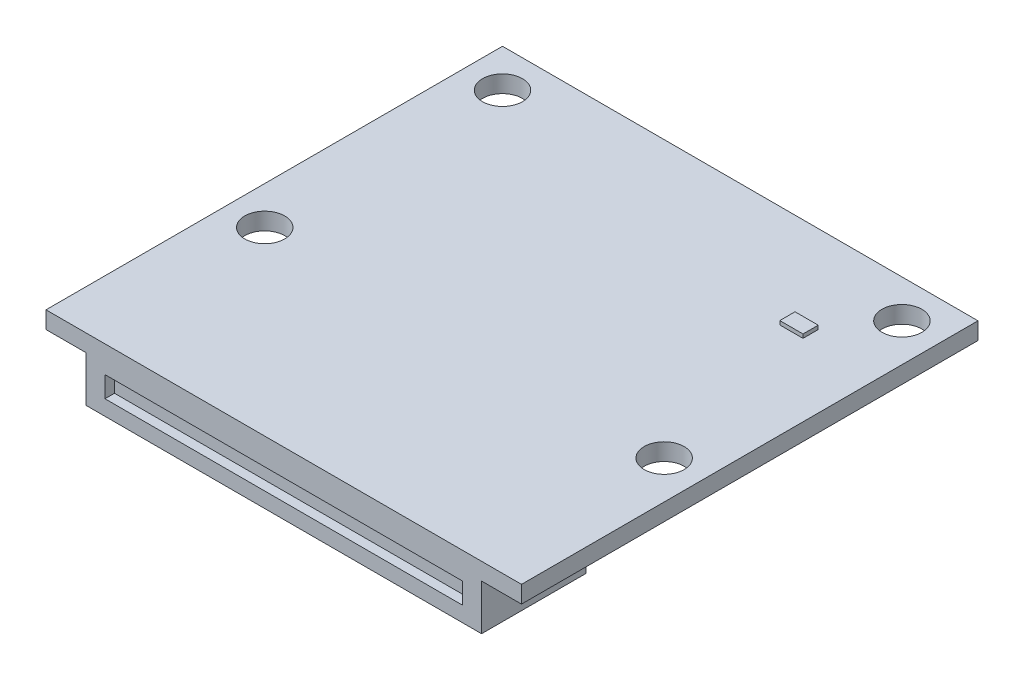
ISO-10303-21;
HEADER;
FILE_DESCRIPTION(('STEP AP214'),'2;1');
FILE_NAME('part.step','',(''),(''),'','','');
FILE_SCHEMA(('AUTOMOTIVE_DESIGN { 1 0 10303 214 1 1 1 1 }'));
ENDSEC;
DATA;
#1=APPLICATION_CONTEXT('core data for automotive mechanical design processes');
#2=APPLICATION_PROTOCOL_DEFINITION('international standard','automotive_design',2000,#1);
#3=PRODUCT_CONTEXT('',#1,'mechanical');
#4=PRODUCT('Part','Part','',(#3));
#5=PRODUCT_RELATED_PRODUCT_CATEGORY('part','',(#4));
#6=PRODUCT_DEFINITION_FORMATION('','',#4);
#7=PRODUCT_DEFINITION_CONTEXT('part definition',#1,'design');
#8=PRODUCT_DEFINITION('design','',#6,#7);
#9=PRODUCT_DEFINITION_SHAPE('','',#8);
#10=(LENGTH_UNIT() NAMED_UNIT(*) SI_UNIT(.MILLI.,.METRE.));
#11=(NAMED_UNIT(*) PLANE_ANGLE_UNIT() SI_UNIT($,.RADIAN.));
#12=(NAMED_UNIT(*) SI_UNIT($,.STERADIAN.) SOLID_ANGLE_UNIT());
#13=UNCERTAINTY_MEASURE_WITH_UNIT(LENGTH_MEASURE(1.E-05),#10,'distance_accuracy_value','');
#14=(GEOMETRIC_REPRESENTATION_CONTEXT(3) GLOBAL_UNCERTAINTY_ASSIGNED_CONTEXT((#13)) GLOBAL_UNIT_ASSIGNED_CONTEXT((#10,
#11,#12)) REPRESENTATION_CONTEXT('',''));
#15=CARTESIAN_POINT('',(0.,0.,0.));
#16=DIRECTION('',(0.,0.,1.));
#17=DIRECTION('',(1.,0.,0.));
#18=AXIS2_PLACEMENT_3D('',#15,#16,#17);
#19=CARTESIAN_POINT('',(0.,0.,0.));
#20=DIRECTION('',(0.,1.,0.));
#21=DIRECTION('',(0.,0.,1.));
#22=AXIS2_PLACEMENT_3D('',#19,#20,#21);
#23=PLANE('',#22);
#24=DIRECTION('',(0.,0.,1.));
#25=VECTOR('',#24,1.);
#26=CARTESIAN_POINT('',(-12.5,0.,-14.5));
#27=LINE('',#26,#25);
#28=CARTESIAN_POINT('',(-12.5,0.,-14.5));
#29=VERTEX_POINT('',#28);
#30=CARTESIAN_POINT('',(-12.5,0.,9.5));
#31=VERTEX_POINT('',#30);
#32=EDGE_CURVE('E275',#29,#31,#27,.T.);
#33=ORIENTED_EDGE('',*,*,#32,.T.);
#34=DIRECTION('',(1.,0.,0.));
#35=VECTOR('',#34,1.);
#36=CARTESIAN_POINT('',(-12.5,0.,9.5));
#37=LINE('',#36,#35);
#38=CARTESIAN_POINT('',(12.5,0.,9.5));
#39=VERTEX_POINT('',#38);
#40=EDGE_CURVE('E278',#31,#39,#37,.T.);
#41=ORIENTED_EDGE('',*,*,#40,.T.);
#42=DIRECTION('',(0.,0.,-1.));
#43=VECTOR('',#42,1.);
#44=CARTESIAN_POINT('',(12.5,0.,-14.5));
#45=LINE('',#44,#43);
#46=CARTESIAN_POINT('',(12.5,0.,-14.5));
#47=VERTEX_POINT('',#46);
#48=EDGE_CURVE('E282',#39,#47,#45,.T.);
#49=ORIENTED_EDGE('',*,*,#48,.T.);
#50=DIRECTION('',(-1.,0.,0.));
#51=VECTOR('',#50,1.);
#52=CARTESIAN_POINT('',(-12.5,0.,-14.5));
#53=LINE('',#52,#51);
#54=EDGE_CURVE('E285',#47,#29,#53,.T.);
#55=ORIENTED_EDGE('',*,*,#54,.T.);
#56=EDGE_LOOP('',(#33,#41,#49,#55));
#57=FACE_BOUND('',#56,.T.);
#58=CARTESIAN_POINT('',(10.5,0.,-12.5));
#59=DIRECTION('',(0.,1.,0.));
#60=DIRECTION('',(0.,0.,1.));
#61=AXIS2_PLACEMENT_3D('',#58,#59,#60);
#62=CIRCLE('',#61,1.05);
#63=CARTESIAN_POINT('',(10.5,0.,-11.45));
#64=VERTEX_POINT('',#63);
#65=EDGE_CURVE('E337',#64,#64,#62,.T.);
#66=ORIENTED_EDGE('',*,*,#65,.F.);
#67=EDGE_LOOP('',(#66));
#68=FACE_BOUND('',#67,.T.);
#69=CARTESIAN_POINT('',(10.5,0.,0.));
#70=DIRECTION('',(0.,1.,0.));
#71=DIRECTION('',(0.,0.,1.));
#72=AXIS2_PLACEMENT_3D('',#69,#70,#71);
#73=CIRCLE('',#72,1.05);
#74=CARTESIAN_POINT('',(10.5,0.,1.05));
#75=VERTEX_POINT('',#74);
#76=EDGE_CURVE('E331',#75,#75,#73,.T.);
#77=ORIENTED_EDGE('',*,*,#76,.F.);
#78=EDGE_LOOP('',(#77));
#79=FACE_BOUND('',#78,.T.);
#80=CARTESIAN_POINT('',(-10.5,0.,0.));
#81=DIRECTION('',(0.,1.,0.));
#82=DIRECTION('',(0.,0.,-1.));
#83=AXIS2_PLACEMENT_3D('',#80,#81,#82);
#84=CIRCLE('',#83,1.05);
#85=CARTESIAN_POINT('',(-10.5,0.,-1.05));
#86=VERTEX_POINT('',#85);
#87=EDGE_CURVE('E326',#86,#86,#84,.T.);
#88=ORIENTED_EDGE('',*,*,#87,.F.);
#89=EDGE_LOOP('',(#88));
#90=FACE_BOUND('',#89,.T.);
#91=CARTESIAN_POINT('',(-10.5,0.,-12.5));
#92=DIRECTION('',(0.,1.,0.));
#93=DIRECTION('',(0.,0.,-1.));
#94=AXIS2_PLACEMENT_3D('',#91,#92,#93);
#95=CIRCLE('',#94,1.05);
#96=CARTESIAN_POINT('',(-10.5,0.,-13.55));
#97=VERTEX_POINT('',#96);
#98=EDGE_CURVE('E320',#97,#97,#95,.T.);
#99=ORIENTED_EDGE('',*,*,#98,.F.);
#100=EDGE_LOOP('',(#99));
#101=FACE_BOUND('',#100,.T.);
#102=DIRECTION('',(-1.,0.,0.));
#103=VECTOR('',#102,1.);
#104=CARTESIAN_POINT('',(8.7,0.,-9.9));
#105=LINE('',#104,#103);
#106=CARTESIAN_POINT('',(8.7,0.,-9.9));
#107=VERTEX_POINT('',#106);
#108=CARTESIAN_POINT('',(7.48,0.,-9.9));
#109=VERTEX_POINT('',#108);
#110=EDGE_CURVE('E204',#107,#109,#105,.T.);
#111=ORIENTED_EDGE('',*,*,#110,.F.);
#112=DIRECTION('',(0.,0.,-1.));
#113=VECTOR('',#112,1.);
#114=CARTESIAN_POINT('',(8.7,0.,-9.1));
#115=LINE('',#114,#113);
#116=CARTESIAN_POINT('',(8.7,0.,-9.1));
#117=VERTEX_POINT('',#116);
#118=EDGE_CURVE('E187',#117,#107,#115,.T.);
#119=ORIENTED_EDGE('',*,*,#118,.F.);
#120=DIRECTION('',(1.,0.,0.));
#121=VECTOR('',#120,1.);
#122=CARTESIAN_POINT('',(8.7,0.,-9.1));
#123=LINE('',#122,#121);
#124=CARTESIAN_POINT('',(7.48,0.,-9.1));
#125=VERTEX_POINT('',#124);
#126=EDGE_CURVE('E195',#125,#117,#123,.T.);
#127=ORIENTED_EDGE('',*,*,#126,.F.);
#128=DIRECTION('',(0.,0.,1.));
#129=VECTOR('',#128,1.);
#130=CARTESIAN_POINT('',(7.48,0.,-9.1));
#131=LINE('',#130,#129);
#132=EDGE_CURVE('E206',#109,#125,#131,.T.);
#133=ORIENTED_EDGE('',*,*,#132,.F.);
#134=EDGE_LOOP('',(#111,#119,#127,#133));
#135=FACE_BOUND('',#134,.T.);
#136=ADVANCED_FACE('F37',(#57,#68,#79,#90,#101,#135),#23,.T.);
#137=CARTESIAN_POINT('',(0.,-0.9,0.));
#138=DIRECTION('',(0.,1.,0.));
#139=DIRECTION('',(0.,0.,1.));
#140=AXIS2_PLACEMENT_3D('',#137,#138,#139);
#141=PLANE('',#140);
#142=CARTESIAN_POINT('',(10.5,-0.9,-12.5));
#143=DIRECTION('',(0.,1.,0.));
#144=DIRECTION('',(0.,0.,1.));
#145=AXIS2_PLACEMENT_3D('',#142,#143,#144);
#146=CIRCLE('',#145,1.05);
#147=CARTESIAN_POINT('',(10.5,-0.9,-11.45));
#148=VERTEX_POINT('',#147);
#149=EDGE_CURVE('E279',#148,#148,#146,.T.);
#150=ORIENTED_EDGE('',*,*,#149,.T.);
#151=EDGE_LOOP('',(#150));
#152=FACE_BOUND('',#151,.T.);
#153=CARTESIAN_POINT('',(10.5,-0.9,0.));
#154=DIRECTION('',(0.,1.,0.));
#155=DIRECTION('',(0.,0.,1.));
#156=AXIS2_PLACEMENT_3D('',#153,#154,#155);
#157=CIRCLE('',#156,1.05);
#158=CARTESIAN_POINT('',(10.5,-0.9,1.05));
#159=VERTEX_POINT('',#158);
#160=EDGE_CURVE('E334',#159,#159,#157,.T.);
#161=ORIENTED_EDGE('',*,*,#160,.T.);
#162=EDGE_LOOP('',(#161));
#163=FACE_BOUND('',#162,.T.);
#164=CARTESIAN_POINT('',(-10.5,-0.9,0.));
#165=DIRECTION('',(0.,1.,0.));
#166=DIRECTION('',(0.,0.,-1.));
#167=AXIS2_PLACEMENT_3D('',#164,#165,#166);
#168=CIRCLE('',#167,1.05);
#169=CARTESIAN_POINT('',(-10.5,-0.9,-1.05));
#170=VERTEX_POINT('',#169);
#171=EDGE_CURVE('E328',#170,#170,#168,.T.);
#172=ORIENTED_EDGE('',*,*,#171,.T.);
#173=EDGE_LOOP('',(#172));
#174=FACE_BOUND('',#173,.T.);
#175=CARTESIAN_POINT('',(-10.5,-0.9,-12.5));
#176=DIRECTION('',(0.,1.,0.));
#177=DIRECTION('',(0.,0.,-1.));
#178=AXIS2_PLACEMENT_3D('',#175,#176,#177);
#179=CIRCLE('',#178,1.05);
#180=CARTESIAN_POINT('',(-10.5,-0.9,-13.55));
#181=VERTEX_POINT('',#180);
#182=EDGE_CURVE('E322',#181,#181,#179,.T.);
#183=ORIENTED_EDGE('',*,*,#182,.T.);
#184=EDGE_LOOP('',(#183));
#185=FACE_BOUND('',#184,.T.);
#186=DIRECTION('',(0.,0.,-1.));
#187=VECTOR('',#186,1.);
#188=CARTESIAN_POINT('',(-10.4,-0.9,9.5));
#189=LINE('',#188,#187);
#190=CARTESIAN_POINT('',(-10.4,-0.9,9.5));
#191=VERTEX_POINT('',#190);
#192=CARTESIAN_POINT('',(-10.4,-0.9,4.));
#193=VERTEX_POINT('',#192);
#194=EDGE_CURVE('E217',#191,#193,#189,.T.);
#195=ORIENTED_EDGE('',*,*,#194,.F.);
#196=DIRECTION('',(1.,0.,0.));
#197=VECTOR('',#196,1.);
#198=CARTESIAN_POINT('',(-12.5,-0.9,9.5));
#199=LINE('',#198,#197);
#200=CARTESIAN_POINT('',(-12.5,-0.9,9.5));
#201=VERTEX_POINT('',#200);
#202=EDGE_CURVE('E260',#201,#191,#199,.T.);
#203=ORIENTED_EDGE('',*,*,#202,.F.);
#204=DIRECTION('',(0.,0.,1.));
#205=VECTOR('',#204,1.);
#206=CARTESIAN_POINT('',(-12.5,-0.9,-14.5));
#207=LINE('',#206,#205);
#208=CARTESIAN_POINT('',(-12.5,-0.9,-14.5));
#209=VERTEX_POINT('',#208);
#210=EDGE_CURVE('E261',#209,#201,#207,.T.);
#211=ORIENTED_EDGE('',*,*,#210,.F.);
#212=DIRECTION('',(-1.,0.,0.));
#213=VECTOR('',#212,1.);
#214=CARTESIAN_POINT('',(-12.5,-0.9,-14.5));
#215=LINE('',#214,#213);
#216=CARTESIAN_POINT('',(12.5,-0.9,-14.5));
#217=VERTEX_POINT('',#216);
#218=EDGE_CURVE('E271',#217,#209,#215,.T.);
#219=ORIENTED_EDGE('',*,*,#218,.F.);
#220=DIRECTION('',(0.,0.,-1.));
#221=VECTOR('',#220,1.);
#222=CARTESIAN_POINT('',(12.5,-0.9,-14.5));
#223=LINE('',#222,#221);
#224=CARTESIAN_POINT('',(12.5,-0.9,9.5));
#225=VERTEX_POINT('',#224);
#226=EDGE_CURVE('E267',#225,#217,#223,.T.);
#227=ORIENTED_EDGE('',*,*,#226,.F.);
#228=CARTESIAN_POINT('',(10.4,-0.9,9.5));
#229=VERTEX_POINT('',#228);
#230=EDGE_CURVE('E257',#229,#225,#199,.T.);
#231=ORIENTED_EDGE('',*,*,#230,.F.);
#232=DIRECTION('',(0.,0.,1.));
#233=VECTOR('',#232,1.);
#234=CARTESIAN_POINT('',(10.4,-0.9,9.5));
#235=LINE('',#234,#233);
#236=CARTESIAN_POINT('',(10.4,-0.9,4.));
#237=VERTEX_POINT('',#236);
#238=EDGE_CURVE('E222',#237,#229,#235,.T.);
#239=ORIENTED_EDGE('',*,*,#238,.F.);
#240=DIRECTION('',(1.,0.,0.));
#241=VECTOR('',#240,1.);
#242=CARTESIAN_POINT('',(-10.4,-0.9,4.));
#243=LINE('',#242,#241);
#244=EDGE_CURVE('E229',#193,#237,#243,.T.);
#245=ORIENTED_EDGE('',*,*,#244,.F.);
#246=EDGE_LOOP('',(#195,#203,#211,#219,#227,#231,#239,#245));
#247=FACE_BOUND('',#246,.T.);
#248=ADVANCED_FACE('F307',(#152,#163,#174,#185,#247),#141,.F.);
#249=CARTESIAN_POINT('',(-12.5,-0.9,-14.5));
#250=DIRECTION('',(-1.,0.,0.));
#251=DIRECTION('',(0.,0.,1.));
#252=AXIS2_PLACEMENT_3D('',#249,#250,#251);
#253=PLANE('',#252);
#254=ORIENTED_EDGE('',*,*,#32,.F.);
#255=DIRECTION('',(0.,1.,0.));
#256=VECTOR('',#255,1.);
#257=CARTESIAN_POINT('',(-12.5,-0.9,-14.5));
#258=LINE('',#257,#256);
#259=EDGE_CURVE('E11',#209,#29,#258,.T.);
#260=ORIENTED_EDGE('',*,*,#259,.F.);
#261=ORIENTED_EDGE('',*,*,#210,.T.);
#262=DIRECTION('',(0.,1.,0.));
#263=VECTOR('',#262,1.);
#264=CARTESIAN_POINT('',(-12.5,-0.9,9.5));
#265=LINE('',#264,#263);
#266=EDGE_CURVE('E274',#201,#31,#265,.T.);
#267=ORIENTED_EDGE('',*,*,#266,.T.);
#268=EDGE_LOOP('',(#254,#260,#261,#267));
#269=FACE_BOUND('',#268,.T.);
#270=ADVANCED_FACE('F39',(#269),#253,.T.);
#271=CARTESIAN_POINT('',(-12.5,-0.9,-14.5));
#272=DIRECTION('',(0.,0.,-1.));
#273=DIRECTION('',(-1.,0.,0.));
#274=AXIS2_PLACEMENT_3D('',#271,#272,#273);
#275=PLANE('',#274);
#276=ORIENTED_EDGE('',*,*,#54,.F.);
#277=DIRECTION('',(0.,1.,0.));
#278=VECTOR('',#277,1.);
#279=CARTESIAN_POINT('',(12.5,-0.9,-14.5));
#280=LINE('',#279,#278);
#281=EDGE_CURVE('E46',#217,#47,#280,.T.);
#282=ORIENTED_EDGE('',*,*,#281,.F.);
#283=ORIENTED_EDGE('',*,*,#218,.T.);
#284=ORIENTED_EDGE('',*,*,#259,.T.);
#285=EDGE_LOOP('',(#276,#282,#283,#284));
#286=FACE_BOUND('',#285,.T.);
#287=ADVANCED_FACE('F304',(#286),#275,.T.);
#288=CARTESIAN_POINT('',(12.5,-0.9,-14.5));
#289=DIRECTION('',(1.,0.,0.));
#290=DIRECTION('',(0.,0.,-1.));
#291=AXIS2_PLACEMENT_3D('',#288,#289,#290);
#292=PLANE('',#291);
#293=ORIENTED_EDGE('',*,*,#48,.F.);
#294=DIRECTION('',(0.,1.,0.));
#295=VECTOR('',#294,1.);
#296=CARTESIAN_POINT('',(12.5,-0.9,9.5));
#297=LINE('',#296,#295);
#298=EDGE_CURVE('E289',#225,#39,#297,.T.);
#299=ORIENTED_EDGE('',*,*,#298,.F.);
#300=ORIENTED_EDGE('',*,*,#226,.T.);
#301=ORIENTED_EDGE('',*,*,#281,.T.);
#302=EDGE_LOOP('',(#293,#299,#300,#301));
#303=FACE_BOUND('',#302,.T.);
#304=ADVANCED_FACE('F414',(#303),#292,.T.);
#305=CARTESIAN_POINT('',(-12.5,-0.9,9.5));
#306=DIRECTION('',(0.,0.,1.));
#307=DIRECTION('',(1.,0.,0.));
#308=AXIS2_PLACEMENT_3D('',#305,#306,#307);
#309=PLANE('',#308);
#310=DIRECTION('',(0.,-1.,0.));
#311=VECTOR('',#310,1.);
#312=CARTESIAN_POINT('',(-9.4,-1.4,9.5));
#313=LINE('',#312,#311);
#314=CARTESIAN_POINT('',(-9.4,-1.4,9.5));
#315=VERTEX_POINT('',#314);
#316=CARTESIAN_POINT('',(-9.4,-2.5,9.5));
#317=VERTEX_POINT('',#316);
#318=EDGE_CURVE('E54',#315,#317,#313,.T.);
#319=ORIENTED_EDGE('',*,*,#318,.F.);
#320=DIRECTION('',(-1.,0.,0.));
#321=VECTOR('',#320,1.);
#322=CARTESIAN_POINT('',(-9.4,-1.4,9.5));
#323=LINE('',#322,#321);
#324=CARTESIAN_POINT('',(9.4,-1.4,9.5));
#325=VERTEX_POINT('',#324);
#326=EDGE_CURVE('E172',#325,#315,#323,.T.);
#327=ORIENTED_EDGE('',*,*,#326,.F.);
#328=DIRECTION('',(0.,1.,0.));
#329=VECTOR('',#328,1.);
#330=CARTESIAN_POINT('',(9.4,-1.4,9.5));
#331=LINE('',#330,#329);
#332=CARTESIAN_POINT('',(9.4,-2.5,9.5));
#333=VERTEX_POINT('',#332);
#334=EDGE_CURVE('E175',#333,#325,#331,.T.);
#335=ORIENTED_EDGE('',*,*,#334,.F.);
#336=DIRECTION('',(1.,0.,0.));
#337=VECTOR('',#336,1.);
#338=CARTESIAN_POINT('',(-9.4,-2.5,9.5));
#339=LINE('',#338,#337);
#340=EDGE_CURVE('E181',#317,#333,#339,.T.);
#341=ORIENTED_EDGE('',*,*,#340,.F.);
#342=EDGE_LOOP('',(#319,#327,#335,#341));
#343=FACE_BOUND('',#342,.T.);
#344=ORIENTED_EDGE('',*,*,#40,.F.);
#345=ORIENTED_EDGE('',*,*,#266,.F.);
#346=ORIENTED_EDGE('',*,*,#202,.T.);
#347=DIRECTION('',(0.,1.,0.));
#348=VECTOR('',#347,1.);
#349=CARTESIAN_POINT('',(-10.4,-3.3,9.5));
#350=LINE('',#349,#348);
#351=CARTESIAN_POINT('',(-10.4,-3.3,9.5));
#352=VERTEX_POINT('',#351);
#353=EDGE_CURVE('E228',#352,#191,#350,.T.);
#354=ORIENTED_EDGE('',*,*,#353,.F.);
#355=DIRECTION('',(-1.,0.,0.));
#356=VECTOR('',#355,1.);
#357=CARTESIAN_POINT('',(-10.4,-3.3,9.5));
#358=LINE('',#357,#356);
#359=CARTESIAN_POINT('',(10.4,-3.3,9.5));
#360=VERTEX_POINT('',#359);
#361=EDGE_CURVE('E226',#360,#352,#358,.T.);
#362=ORIENTED_EDGE('',*,*,#361,.F.);
#363=DIRECTION('',(0.,1.,0.));
#364=VECTOR('',#363,1.);
#365=CARTESIAN_POINT('',(10.4,-3.3,9.5));
#366=LINE('',#365,#364);
#367=EDGE_CURVE('E241',#360,#229,#366,.T.);
#368=ORIENTED_EDGE('',*,*,#367,.T.);
#369=ORIENTED_EDGE('',*,*,#230,.T.);
#370=ORIENTED_EDGE('',*,*,#298,.T.);
#371=EDGE_LOOP('',(#344,#345,#346,#354,#362,#368,#369,#370));
#372=FACE_BOUND('',#371,.T.);
#373=ADVANCED_FACE('F297',(#343,#372),#309,.T.);
#374=CARTESIAN_POINT('',(10.5,-0.9,-12.5));
#375=DIRECTION('',(0.,1.,0.));
#376=DIRECTION('',(0.,0.,1.));
#377=AXIS2_PLACEMENT_3D('',#374,#375,#376);
#378=CYLINDRICAL_SURFACE('',#377,1.05);
#379=ORIENTED_EDGE('',*,*,#149,.F.);
#380=EDGE_LOOP('',(#379));
#381=FACE_BOUND('',#380,.T.);
#382=ORIENTED_EDGE('',*,*,#65,.T.);
#383=EDGE_LOOP('',(#382));
#384=FACE_BOUND('',#383,.T.);
#385=ADVANCED_FACE('F344',(#381,#384),#378,.F.);
#386=CARTESIAN_POINT('',(10.5,-0.9,0.));
#387=DIRECTION('',(0.,1.,0.));
#388=DIRECTION('',(0.,0.,1.));
#389=AXIS2_PLACEMENT_3D('',#386,#387,#388);
#390=CYLINDRICAL_SURFACE('',#389,1.05);
#391=ORIENTED_EDGE('',*,*,#160,.F.);
#392=EDGE_LOOP('',(#391));
#393=FACE_BOUND('',#392,.T.);
#394=ORIENTED_EDGE('',*,*,#76,.T.);
#395=EDGE_LOOP('',(#394));
#396=FACE_BOUND('',#395,.T.);
#397=ADVANCED_FACE('F401',(#393,#396),#390,.F.);
#398=CARTESIAN_POINT('',(-10.5,-0.9,0.));
#399=DIRECTION('',(0.,1.,0.));
#400=DIRECTION('',(0.,0.,1.));
#401=AXIS2_PLACEMENT_3D('',#398,#399,#400);
#402=CYLINDRICAL_SURFACE('',#401,1.05);
#403=ORIENTED_EDGE('',*,*,#171,.F.);
#404=EDGE_LOOP('',(#403));
#405=FACE_BOUND('',#404,.T.);
#406=ORIENTED_EDGE('',*,*,#87,.T.);
#407=EDGE_LOOP('',(#406));
#408=FACE_BOUND('',#407,.T.);
#409=ADVANCED_FACE('F397',(#405,#408),#402,.F.);
#410=CARTESIAN_POINT('',(-10.5,-0.9,-12.5));
#411=DIRECTION('',(0.,1.,0.));
#412=DIRECTION('',(0.,0.,1.));
#413=AXIS2_PLACEMENT_3D('',#410,#411,#412);
#414=CYLINDRICAL_SURFACE('',#413,1.05);
#415=ORIENTED_EDGE('',*,*,#182,.F.);
#416=EDGE_LOOP('',(#415));
#417=FACE_BOUND('',#416,.T.);
#418=ORIENTED_EDGE('',*,*,#98,.T.);
#419=EDGE_LOOP('',(#418));
#420=FACE_BOUND('',#419,.T.);
#421=ADVANCED_FACE('F394',(#417,#420),#414,.F.);
#422=CARTESIAN_POINT('',(-10.4,-3.3,9.5));
#423=DIRECTION('',(1.,0.,0.));
#424=DIRECTION('',(0.,0.,-1.));
#425=AXIS2_PLACEMENT_3D('',#422,#423,#424);
#426=PLANE('',#425);
#427=ORIENTED_EDGE('',*,*,#194,.T.);
#428=DIRECTION('',(0.,1.,0.));
#429=VECTOR('',#428,1.);
#430=CARTESIAN_POINT('',(-10.4,-3.3,4.));
#431=LINE('',#430,#429);
#432=CARTESIAN_POINT('',(-10.4,-3.3,4.));
#433=VERTEX_POINT('',#432);
#434=EDGE_CURVE('E247',#433,#193,#431,.T.);
#435=ORIENTED_EDGE('',*,*,#434,.F.);
#436=DIRECTION('',(0.,0.,-1.));
#437=VECTOR('',#436,1.);
#438=CARTESIAN_POINT('',(-10.4,-3.3,9.5));
#439=LINE('',#438,#437);
#440=EDGE_CURVE('E218',#352,#433,#439,.T.);
#441=ORIENTED_EDGE('',*,*,#440,.F.);
#442=ORIENTED_EDGE('',*,*,#353,.T.);
#443=EDGE_LOOP('',(#427,#435,#441,#442));
#444=FACE_BOUND('',#443,.T.);
#445=ADVANCED_FACE('F310',(#444),#426,.F.);
#446=CARTESIAN_POINT('',(-10.4,-3.3,4.));
#447=DIRECTION('',(0.,0.,1.));
#448=DIRECTION('',(1.,0.,0.));
#449=AXIS2_PLACEMENT_3D('',#446,#447,#448);
#450=PLANE('',#449);
#451=ORIENTED_EDGE('',*,*,#244,.T.);
#452=DIRECTION('',(0.,1.,0.));
#453=VECTOR('',#452,1.);
#454=CARTESIAN_POINT('',(10.4,-3.3,4.));
#455=LINE('',#454,#453);
#456=CARTESIAN_POINT('',(10.4,-3.3,4.));
#457=VERTEX_POINT('',#456);
#458=EDGE_CURVE('E234',#457,#237,#455,.T.);
#459=ORIENTED_EDGE('',*,*,#458,.F.);
#460=DIRECTION('',(1.,0.,0.));
#461=VECTOR('',#460,1.);
#462=CARTESIAN_POINT('',(-10.4,-3.3,4.));
#463=LINE('',#462,#461);
#464=EDGE_CURVE('E221',#433,#457,#463,.T.);
#465=ORIENTED_EDGE('',*,*,#464,.F.);
#466=ORIENTED_EDGE('',*,*,#434,.T.);
#467=EDGE_LOOP('',(#451,#459,#465,#466));
#468=FACE_BOUND('',#467,.T.);
#469=ADVANCED_FACE('F319',(#468),#450,.F.);
#470=CARTESIAN_POINT('',(10.4,-3.3,9.5));
#471=DIRECTION('',(-1.,0.,0.));
#472=DIRECTION('',(0.,0.,1.));
#473=AXIS2_PLACEMENT_3D('',#470,#471,#472);
#474=PLANE('',#473);
#475=ORIENTED_EDGE('',*,*,#238,.T.);
#476=ORIENTED_EDGE('',*,*,#367,.F.);
#477=DIRECTION('',(0.,0.,1.));
#478=VECTOR('',#477,1.);
#479=CARTESIAN_POINT('',(10.4,-3.3,9.5));
#480=LINE('',#479,#478);
#481=EDGE_CURVE('E224',#457,#360,#480,.T.);
#482=ORIENTED_EDGE('',*,*,#481,.F.);
#483=ORIENTED_EDGE('',*,*,#458,.T.);
#484=EDGE_LOOP('',(#475,#476,#482,#483));
#485=FACE_BOUND('',#484,.T.);
#486=ADVANCED_FACE('F317',(#485),#474,.F.);
#487=CARTESIAN_POINT('',(0.,-3.3,0.));
#488=DIRECTION('',(0.,-1.,0.));
#489=DIRECTION('',(0.,0.,-1.));
#490=AXIS2_PLACEMENT_3D('',#487,#488,#489);
#491=PLANE('',#490);
#492=ORIENTED_EDGE('',*,*,#440,.T.);
#493=ORIENTED_EDGE('',*,*,#464,.T.);
#494=ORIENTED_EDGE('',*,*,#481,.T.);
#495=ORIENTED_EDGE('',*,*,#361,.T.);
#496=EDGE_LOOP('',(#492,#493,#494,#495));
#497=FACE_BOUND('',#496,.T.);
#498=ADVANCED_FACE('F313',(#497),#491,.T.);
#499=CARTESIAN_POINT('',(8.7,0.2,-9.1));
#500=DIRECTION('',(-1.,0.,0.));
#501=DIRECTION('',(0.,0.,1.));
#502=AXIS2_PLACEMENT_3D('',#499,#500,#501);
#503=PLANE('',#502);
#504=ORIENTED_EDGE('',*,*,#118,.T.);
#505=DIRECTION('',(0.,-1.,0.));
#506=VECTOR('',#505,1.);
#507=CARTESIAN_POINT('',(8.7,0.2,-9.9));
#508=LINE('',#507,#506);
#509=CARTESIAN_POINT('',(8.7,0.2,-9.9));
#510=VERTEX_POINT('',#509);
#511=EDGE_CURVE('E215',#510,#107,#508,.T.);
#512=ORIENTED_EDGE('',*,*,#511,.F.);
#513=DIRECTION('',(0.,0.,-1.));
#514=VECTOR('',#513,1.);
#515=CARTESIAN_POINT('',(8.7,0.2,-9.1));
#516=LINE('',#515,#514);
#517=CARTESIAN_POINT('',(8.7,0.2,-9.1));
#518=VERTEX_POINT('',#517);
#519=EDGE_CURVE('E191',#518,#510,#516,.T.);
#520=ORIENTED_EDGE('',*,*,#519,.F.);
#521=DIRECTION('',(0.,-1.,0.));
#522=VECTOR('',#521,1.);
#523=CARTESIAN_POINT('',(8.7,0.2,-9.1));
#524=LINE('',#523,#522);
#525=EDGE_CURVE('E201',#518,#117,#524,.T.);
#526=ORIENTED_EDGE('',*,*,#525,.T.);
#527=EDGE_LOOP('',(#504,#512,#520,#526));
#528=FACE_BOUND('',#527,.T.);
#529=ADVANCED_FACE('F370',(#528),#503,.F.);
#530=CARTESIAN_POINT('',(8.7,0.2,-9.9));
#531=DIRECTION('',(0.,0.,1.));
#532=DIRECTION('',(1.,0.,0.));
#533=AXIS2_PLACEMENT_3D('',#530,#531,#532);
#534=PLANE('',#533);
#535=ORIENTED_EDGE('',*,*,#110,.T.);
#536=DIRECTION('',(0.,-1.,0.));
#537=VECTOR('',#536,1.);
#538=CARTESIAN_POINT('',(7.48,0.2,-9.9));
#539=LINE('',#538,#537);
#540=CARTESIAN_POINT('',(7.48,0.2,-9.9));
#541=VERTEX_POINT('',#540);
#542=EDGE_CURVE('E212',#541,#109,#539,.T.);
#543=ORIENTED_EDGE('',*,*,#542,.F.);
#544=DIRECTION('',(-1.,0.,0.));
#545=VECTOR('',#544,1.);
#546=CARTESIAN_POINT('',(8.7,0.2,-9.9));
#547=LINE('',#546,#545);
#548=EDGE_CURVE('E194',#510,#541,#547,.T.);
#549=ORIENTED_EDGE('',*,*,#548,.F.);
#550=ORIENTED_EDGE('',*,*,#511,.T.);
#551=EDGE_LOOP('',(#535,#543,#549,#550));
#552=FACE_BOUND('',#551,.T.);
#553=ADVANCED_FACE('F360',(#552),#534,.F.);
#554=CARTESIAN_POINT('',(7.48,0.2,-9.1));
#555=DIRECTION('',(1.,0.,0.));
#556=DIRECTION('',(0.,0.,-1.));
#557=AXIS2_PLACEMENT_3D('',#554,#555,#556);
#558=PLANE('',#557);
#559=ORIENTED_EDGE('',*,*,#132,.T.);
#560=DIRECTION('',(0.,-1.,0.));
#561=VECTOR('',#560,1.);
#562=CARTESIAN_POINT('',(7.48,0.2,-9.1));
#563=LINE('',#562,#561);
#564=CARTESIAN_POINT('',(7.48,0.2,-9.1));
#565=VERTEX_POINT('',#564);
#566=EDGE_CURVE('E62',#565,#125,#563,.T.);
#567=ORIENTED_EDGE('',*,*,#566,.F.);
#568=DIRECTION('',(0.,0.,1.));
#569=VECTOR('',#568,1.);
#570=CARTESIAN_POINT('',(7.48,0.2,-9.1));
#571=LINE('',#570,#569);
#572=EDGE_CURVE('E197',#541,#565,#571,.T.);
#573=ORIENTED_EDGE('',*,*,#572,.F.);
#574=ORIENTED_EDGE('',*,*,#542,.T.);
#575=EDGE_LOOP('',(#559,#567,#573,#574));
#576=FACE_BOUND('',#575,.T.);
#577=ADVANCED_FACE('F364',(#576),#558,.F.);
#578=CARTESIAN_POINT('',(8.7,0.2,-9.1));
#579=DIRECTION('',(0.,0.,-1.));
#580=DIRECTION('',(-1.,0.,0.));
#581=AXIS2_PLACEMENT_3D('',#578,#579,#580);
#582=PLANE('',#581);
#583=ORIENTED_EDGE('',*,*,#126,.T.);
#584=ORIENTED_EDGE('',*,*,#525,.F.);
#585=DIRECTION('',(1.,0.,0.));
#586=VECTOR('',#585,1.);
#587=CARTESIAN_POINT('',(8.7,0.2,-9.1));
#588=LINE('',#587,#586);
#589=EDGE_CURVE('E199',#565,#518,#588,.T.);
#590=ORIENTED_EDGE('',*,*,#589,.F.);
#591=ORIENTED_EDGE('',*,*,#566,.T.);
#592=EDGE_LOOP('',(#583,#584,#590,#591));
#593=FACE_BOUND('',#592,.T.);
#594=ADVANCED_FACE('F371',(#593),#582,.F.);
#595=CARTESIAN_POINT('',(0.,0.2,0.));
#596=DIRECTION('',(0.,1.,0.));
#597=DIRECTION('',(0.,0.,1.));
#598=AXIS2_PLACEMENT_3D('',#595,#596,#597);
#599=PLANE('',#598);
#600=ORIENTED_EDGE('',*,*,#519,.T.);
#601=ORIENTED_EDGE('',*,*,#548,.T.);
#602=ORIENTED_EDGE('',*,*,#572,.T.);
#603=ORIENTED_EDGE('',*,*,#589,.T.);
#604=EDGE_LOOP('',(#600,#601,#602,#603));
#605=FACE_BOUND('',#604,.T.);
#606=ADVANCED_FACE('F366',(#605),#599,.T.);
#607=CARTESIAN_POINT('',(-9.4,-1.4,9.));
#608=DIRECTION('',(-1.,0.,0.));
#609=DIRECTION('',(0.,0.,1.));
#610=AXIS2_PLACEMENT_3D('',#607,#608,#609);
#611=PLANE('',#610);
#612=ORIENTED_EDGE('',*,*,#318,.T.);
#613=DIRECTION('',(0.,0.,1.));
#614=VECTOR('',#613,1.);
#615=CARTESIAN_POINT('',(-9.4,-2.5,9.));
#616=LINE('',#615,#614);
#617=CARTESIAN_POINT('',(-9.4,-2.5,9.));
#618=VERTEX_POINT('',#617);
#619=EDGE_CURVE('E150',#618,#317,#616,.T.);
#620=ORIENTED_EDGE('',*,*,#619,.F.);
#621=DIRECTION('',(0.,-1.,0.));
#622=VECTOR('',#621,1.);
#623=CARTESIAN_POINT('',(-9.4,-1.4,9.));
#624=LINE('',#623,#622);
#625=CARTESIAN_POINT('',(-9.4,-1.4,9.));
#626=VERTEX_POINT('',#625);
#627=EDGE_CURVE('E154',#626,#618,#624,.T.);
#628=ORIENTED_EDGE('',*,*,#627,.F.);
#629=DIRECTION('',(0.,0.,1.));
#630=VECTOR('',#629,1.);
#631=CARTESIAN_POINT('',(-9.4,-1.4,9.));
#632=LINE('',#631,#630);
#633=EDGE_CURVE('E185',#626,#315,#632,.T.);
#634=ORIENTED_EDGE('',*,*,#633,.T.);
#635=EDGE_LOOP('',(#612,#620,#628,#634));
#636=FACE_BOUND('',#635,.T.);
#637=ADVANCED_FACE('F152',(#636),#611,.F.);
#638=CARTESIAN_POINT('',(-9.4,-1.4,9.));
#639=DIRECTION('',(0.,1.,0.));
#640=DIRECTION('',(0.,0.,1.));
#641=AXIS2_PLACEMENT_3D('',#638,#639,#640);
#642=PLANE('',#641);
#643=ORIENTED_EDGE('',*,*,#326,.T.);
#644=ORIENTED_EDGE('',*,*,#633,.F.);
#645=DIRECTION('',(-1.,0.,0.));
#646=VECTOR('',#645,1.);
#647=CARTESIAN_POINT('',(-9.4,-1.4,9.));
#648=LINE('',#647,#646);
#649=CARTESIAN_POINT('',(9.4,-1.4,9.));
#650=VERTEX_POINT('',#649);
#651=EDGE_CURVE('E160',#650,#626,#648,.T.);
#652=ORIENTED_EDGE('',*,*,#651,.F.);
#653=DIRECTION('',(0.,0.,1.));
#654=VECTOR('',#653,1.);
#655=CARTESIAN_POINT('',(9.4,-1.4,9.));
#656=LINE('',#655,#654);
#657=EDGE_CURVE('E188',#650,#325,#656,.T.);
#658=ORIENTED_EDGE('',*,*,#657,.T.);
#659=EDGE_LOOP('',(#643,#644,#652,#658));
#660=FACE_BOUND('',#659,.T.);
#661=ADVANCED_FACE('F426',(#660),#642,.F.);
#662=CARTESIAN_POINT('',(9.4,-1.4,9.));
#663=DIRECTION('',(1.,0.,0.));
#664=DIRECTION('',(0.,0.,-1.));
#665=AXIS2_PLACEMENT_3D('',#662,#663,#664);
#666=PLANE('',#665);
#667=ORIENTED_EDGE('',*,*,#334,.T.);
#668=ORIENTED_EDGE('',*,*,#657,.F.);
#669=DIRECTION('',(0.,1.,0.));
#670=VECTOR('',#669,1.);
#671=CARTESIAN_POINT('',(9.4,-1.4,9.));
#672=LINE('',#671,#670);
#673=CARTESIAN_POINT('',(9.4,-2.5,9.));
#674=VERTEX_POINT('',#673);
#675=EDGE_CURVE('E168',#674,#650,#672,.T.);
#676=ORIENTED_EDGE('',*,*,#675,.F.);
#677=DIRECTION('',(0.,0.,1.));
#678=VECTOR('',#677,1.);
#679=CARTESIAN_POINT('',(9.4,-2.5,9.));
#680=LINE('',#679,#678);
#681=EDGE_CURVE('E159',#674,#333,#680,.T.);
#682=ORIENTED_EDGE('',*,*,#681,.T.);
#683=EDGE_LOOP('',(#667,#668,#676,#682));
#684=FACE_BOUND('',#683,.T.);
#685=ADVANCED_FACE('F424',(#684),#666,.F.);
#686=CARTESIAN_POINT('',(-9.4,-2.5,9.));
#687=DIRECTION('',(0.,-1.,0.));
#688=DIRECTION('',(0.,0.,-1.));
#689=AXIS2_PLACEMENT_3D('',#686,#687,#688);
#690=PLANE('',#689);
#691=ORIENTED_EDGE('',*,*,#340,.T.);
#692=ORIENTED_EDGE('',*,*,#681,.F.);
#693=DIRECTION('',(1.,0.,0.));
#694=VECTOR('',#693,1.);
#695=CARTESIAN_POINT('',(-9.4,-2.5,9.));
#696=LINE('',#695,#694);
#697=EDGE_CURVE('E163',#618,#674,#696,.T.);
#698=ORIENTED_EDGE('',*,*,#697,.F.);
#699=ORIENTED_EDGE('',*,*,#619,.T.);
#700=EDGE_LOOP('',(#691,#692,#698,#699));
#701=FACE_BOUND('',#700,.T.);
#702=ADVANCED_FACE('F164',(#701),#690,.F.);
#703=CARTESIAN_POINT('',(0.,0.,9.));
#704=DIRECTION('',(0.,0.,1.));
#705=DIRECTION('',(1.,0.,0.));
#706=AXIS2_PLACEMENT_3D('',#703,#704,#705);
#707=PLANE('',#706);
#708=ORIENTED_EDGE('',*,*,#627,.T.);
#709=ORIENTED_EDGE('',*,*,#697,.T.);
#710=ORIENTED_EDGE('',*,*,#675,.T.);
#711=ORIENTED_EDGE('',*,*,#651,.T.);
#712=EDGE_LOOP('',(#708,#709,#710,#711));
#713=FACE_BOUND('',#712,.T.);
#714=ADVANCED_FACE('F170',(#713),#707,.T.);
#715=CLOSED_SHELL('',(#136,#248,#270,#287,#304,#373,#385,#397,#409,#421,#445,#469,#486,#498,
#529,#553,#577,#594,#606,#637,#661,#685,#702,#714));
#716=MANIFOLD_SOLID_BREP('B2',#715);
#717=ADVANCED_BREP_SHAPE_REPRESENTATION('',(#18,#716),#14);
#718=SHAPE_DEFINITION_REPRESENTATION(#9,#717);
ENDSEC;
END-ISO-10303-21;
